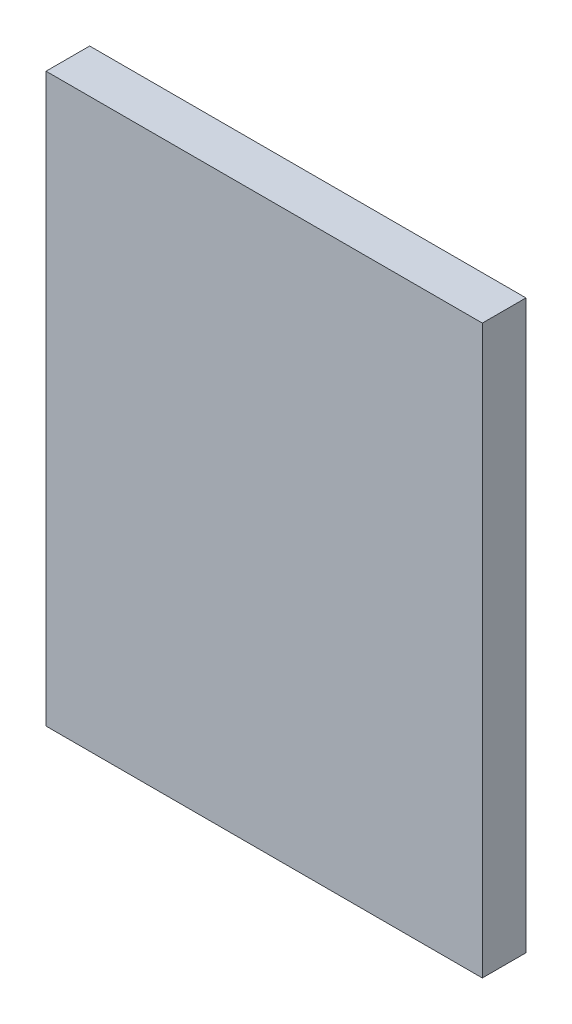
ISO-10303-21;
HEADER;
FILE_DESCRIPTION(('STEP AP214'),'2;1');
FILE_NAME('part.step','',(''),(''),'','','');
FILE_SCHEMA(('AUTOMOTIVE_DESIGN { 1 0 10303 214 1 1 1 1 }'));
ENDSEC;
DATA;
#1=APPLICATION_CONTEXT('core data for automotive mechanical design processes');
#2=APPLICATION_PROTOCOL_DEFINITION('international standard','automotive_design',2000,#1);
#3=PRODUCT_CONTEXT('',#1,'mechanical');
#4=PRODUCT('Part','Part','',(#3));
#5=PRODUCT_RELATED_PRODUCT_CATEGORY('part','',(#4));
#6=PRODUCT_DEFINITION_FORMATION('','',#4);
#7=PRODUCT_DEFINITION_CONTEXT('part definition',#1,'design');
#8=PRODUCT_DEFINITION('design','',#6,#7);
#9=PRODUCT_DEFINITION_SHAPE('','',#8);
#10=(LENGTH_UNIT() NAMED_UNIT(*) SI_UNIT(.MILLI.,.METRE.));
#11=(NAMED_UNIT(*) PLANE_ANGLE_UNIT() SI_UNIT($,.RADIAN.));
#12=(NAMED_UNIT(*) SI_UNIT($,.STERADIAN.) SOLID_ANGLE_UNIT());
#13=UNCERTAINTY_MEASURE_WITH_UNIT(LENGTH_MEASURE(1.E-05),#10,'distance_accuracy_value','');
#14=(GEOMETRIC_REPRESENTATION_CONTEXT(3) GLOBAL_UNCERTAINTY_ASSIGNED_CONTEXT((#13)) GLOBAL_UNIT_ASSIGNED_CONTEXT((#10,
#11,#12)) REPRESENTATION_CONTEXT('',''));
#15=CARTESIAN_POINT('',(0.,0.,0.));
#16=DIRECTION('',(0.,0.,1.));
#17=DIRECTION('',(1.,0.,0.));
#18=AXIS2_PLACEMENT_3D('',#15,#16,#17);
#19=CARTESIAN_POINT('',(95.25,-123.825,19.05));
#20=DIRECTION('',(-1.,0.,0.));
#21=DIRECTION('',(0.,0.,1.));
#22=AXIS2_PLACEMENT_3D('',#19,#20,#21);
#23=PLANE('',#22);
#24=DIRECTION('',(0.,1.,0.));
#25=VECTOR('',#24,1.);
#26=CARTESIAN_POINT('',(95.25,-123.825,0.));
#27=LINE('',#26,#25);
#28=CARTESIAN_POINT('',(95.25,-123.825,0.));
#29=VERTEX_POINT('',#28);
#30=CARTESIAN_POINT('',(95.25,123.825,0.));
#31=VERTEX_POINT('',#30);
#32=EDGE_CURVE('E107',#29,#31,#27,.T.);
#33=ORIENTED_EDGE('',*,*,#32,.T.);
#34=DIRECTION('',(0.,0.,-1.));
#35=VECTOR('',#34,1.);
#36=CARTESIAN_POINT('',(95.25,123.825,19.05));
#37=LINE('',#36,#35);
#38=CARTESIAN_POINT('',(95.25,123.825,19.05));
#39=VERTEX_POINT('',#38);
#40=EDGE_CURVE('E11',#39,#31,#37,.T.);
#41=ORIENTED_EDGE('',*,*,#40,.F.);
#42=DIRECTION('',(0.,1.,0.));
#43=VECTOR('',#42,1.);
#44=CARTESIAN_POINT('',(95.25,-123.825,19.05));
#45=LINE('',#44,#43);
#46=CARTESIAN_POINT('',(95.25,-123.825,19.05));
#47=VERTEX_POINT('',#46);
#48=EDGE_CURVE('E91',#47,#39,#45,.T.);
#49=ORIENTED_EDGE('',*,*,#48,.F.);
#50=DIRECTION('',(0.,0.,-1.));
#51=VECTOR('',#50,1.);
#52=CARTESIAN_POINT('',(95.25,-123.825,19.05));
#53=LINE('',#52,#51);
#54=EDGE_CURVE('E103',#47,#29,#53,.T.);
#55=ORIENTED_EDGE('',*,*,#54,.T.);
#56=EDGE_LOOP('',(#33,#41,#49,#55));
#57=FACE_BOUND('',#56,.T.);
#58=ADVANCED_FACE('F39',(#57),#23,.F.);
#59=CARTESIAN_POINT('',(-95.25,123.825,19.05));
#60=DIRECTION('',(0.,-1.,0.));
#61=DIRECTION('',(0.,0.,-1.));
#62=AXIS2_PLACEMENT_3D('',#59,#60,#61);
#63=PLANE('',#62);
#64=DIRECTION('',(-1.,0.,0.));
#65=VECTOR('',#64,1.);
#66=CARTESIAN_POINT('',(-95.25,123.825,0.));
#67=LINE('',#66,#65);
#68=CARTESIAN_POINT('',(-95.25,123.825,0.));
#69=VERTEX_POINT('',#68);
#70=EDGE_CURVE('E96',#31,#69,#67,.T.);
#71=ORIENTED_EDGE('',*,*,#70,.T.);
#72=DIRECTION('',(0.,0.,-1.));
#73=VECTOR('',#72,1.);
#74=CARTESIAN_POINT('',(-95.25,123.825,19.05));
#75=LINE('',#74,#73);
#76=CARTESIAN_POINT('',(-95.25,123.825,19.05));
#77=VERTEX_POINT('',#76);
#78=EDGE_CURVE('E48',#77,#69,#75,.T.);
#79=ORIENTED_EDGE('',*,*,#78,.F.);
#80=DIRECTION('',(-1.,0.,0.));
#81=VECTOR('',#80,1.);
#82=CARTESIAN_POINT('',(-95.25,123.825,19.05));
#83=LINE('',#82,#81);
#84=EDGE_CURVE('E86',#39,#77,#83,.T.);
#85=ORIENTED_EDGE('',*,*,#84,.F.);
#86=ORIENTED_EDGE('',*,*,#40,.T.);
#87=EDGE_LOOP('',(#71,#79,#85,#86));
#88=FACE_BOUND('',#87,.T.);
#89=ADVANCED_FACE('F95',(#88),#63,.F.);
#90=CARTESIAN_POINT('',(-95.25,-123.825,19.05));
#91=DIRECTION('',(1.,0.,0.));
#92=DIRECTION('',(0.,0.,-1.));
#93=AXIS2_PLACEMENT_3D('',#90,#91,#92);
#94=PLANE('',#93);
#95=DIRECTION('',(0.,-1.,0.));
#96=VECTOR('',#95,1.);
#97=CARTESIAN_POINT('',(-95.25,-123.825,0.));
#98=LINE('',#97,#96);
#99=CARTESIAN_POINT('',(-95.25,-123.825,0.));
#100=VERTEX_POINT('',#99);
#101=EDGE_CURVE('E73',#69,#100,#98,.T.);
#102=ORIENTED_EDGE('',*,*,#101,.T.);
#103=DIRECTION('',(0.,0.,-1.));
#104=VECTOR('',#103,1.);
#105=CARTESIAN_POINT('',(-95.25,-123.825,19.05));
#106=LINE('',#105,#104);
#107=CARTESIAN_POINT('',(-95.25,-123.825,19.05));
#108=VERTEX_POINT('',#107);
#109=EDGE_CURVE('E98',#108,#100,#106,.T.);
#110=ORIENTED_EDGE('',*,*,#109,.F.);
#111=DIRECTION('',(0.,-1.,0.));
#112=VECTOR('',#111,1.);
#113=CARTESIAN_POINT('',(-95.25,-123.825,19.05));
#114=LINE('',#113,#112);
#115=EDGE_CURVE('E89',#77,#108,#114,.T.);
#116=ORIENTED_EDGE('',*,*,#115,.F.);
#117=ORIENTED_EDGE('',*,*,#78,.T.);
#118=EDGE_LOOP('',(#102,#110,#116,#117));
#119=FACE_BOUND('',#118,.T.);
#120=ADVANCED_FACE('F99',(#119),#94,.F.);
#121=CARTESIAN_POINT('',(-95.25,-123.825,19.05));
#122=DIRECTION('',(0.,1.,0.));
#123=DIRECTION('',(0.,0.,1.));
#124=AXIS2_PLACEMENT_3D('',#121,#122,#123);
#125=PLANE('',#124);
#126=DIRECTION('',(1.,0.,0.));
#127=VECTOR('',#126,1.);
#128=CARTESIAN_POINT('',(-95.25,-123.825,0.));
#129=LINE('',#128,#127);
#130=EDGE_CURVE('E79',#100,#29,#129,.T.);
#131=ORIENTED_EDGE('',*,*,#130,.T.);
#132=ORIENTED_EDGE('',*,*,#54,.F.);
#133=DIRECTION('',(1.,0.,0.));
#134=VECTOR('',#133,1.);
#135=CARTESIAN_POINT('',(-95.25,-123.825,19.05));
#136=LINE('',#135,#134);
#137=EDGE_CURVE('E56',#108,#47,#136,.T.);
#138=ORIENTED_EDGE('',*,*,#137,.F.);
#139=ORIENTED_EDGE('',*,*,#109,.T.);
#140=EDGE_LOOP('',(#131,#132,#138,#139));
#141=FACE_BOUND('',#140,.T.);
#142=ADVANCED_FACE('F120',(#141),#125,.F.);
#143=CARTESIAN_POINT('',(0.,0.,19.05));
#144=DIRECTION('',(0.,0.,-1.));
#145=DIRECTION('',(-1.,0.,0.));
#146=AXIS2_PLACEMENT_3D('',#143,#144,#145);
#147=PLANE('',#146);
#148=ORIENTED_EDGE('',*,*,#48,.T.);
#149=ORIENTED_EDGE('',*,*,#84,.T.);
#150=ORIENTED_EDGE('',*,*,#115,.T.);
#151=ORIENTED_EDGE('',*,*,#137,.T.);
#152=EDGE_LOOP('',(#148,#149,#150,#151));
#153=FACE_BOUND('',#152,.T.);
#154=ADVANCED_FACE('F87',(#153),#147,.F.);
#155=CARTESIAN_POINT('',(0.,0.,0.));
#156=DIRECTION('',(0.,0.,-1.));
#157=DIRECTION('',(-1.,0.,0.));
#158=AXIS2_PLACEMENT_3D('',#155,#156,#157);
#159=PLANE('',#158);
#160=ORIENTED_EDGE('',*,*,#32,.F.);
#161=ORIENTED_EDGE('',*,*,#130,.F.);
#162=ORIENTED_EDGE('',*,*,#101,.F.);
#163=ORIENTED_EDGE('',*,*,#70,.F.);
#164=EDGE_LOOP('',(#160,#161,#162,#163));
#165=FACE_BOUND('',#164,.T.);
#166=ADVANCED_FACE('F123',(#165),#159,.T.);
#167=CLOSED_SHELL('',(#58,#89,#120,#142,#154,#166));
#168=MANIFOLD_SOLID_BREP('B2',#167);
#169=ADVANCED_BREP_SHAPE_REPRESENTATION('',(#18,#168),#14);
#170=SHAPE_DEFINITION_REPRESENTATION(#9,#169);
ENDSEC;
END-ISO-10303-21;
